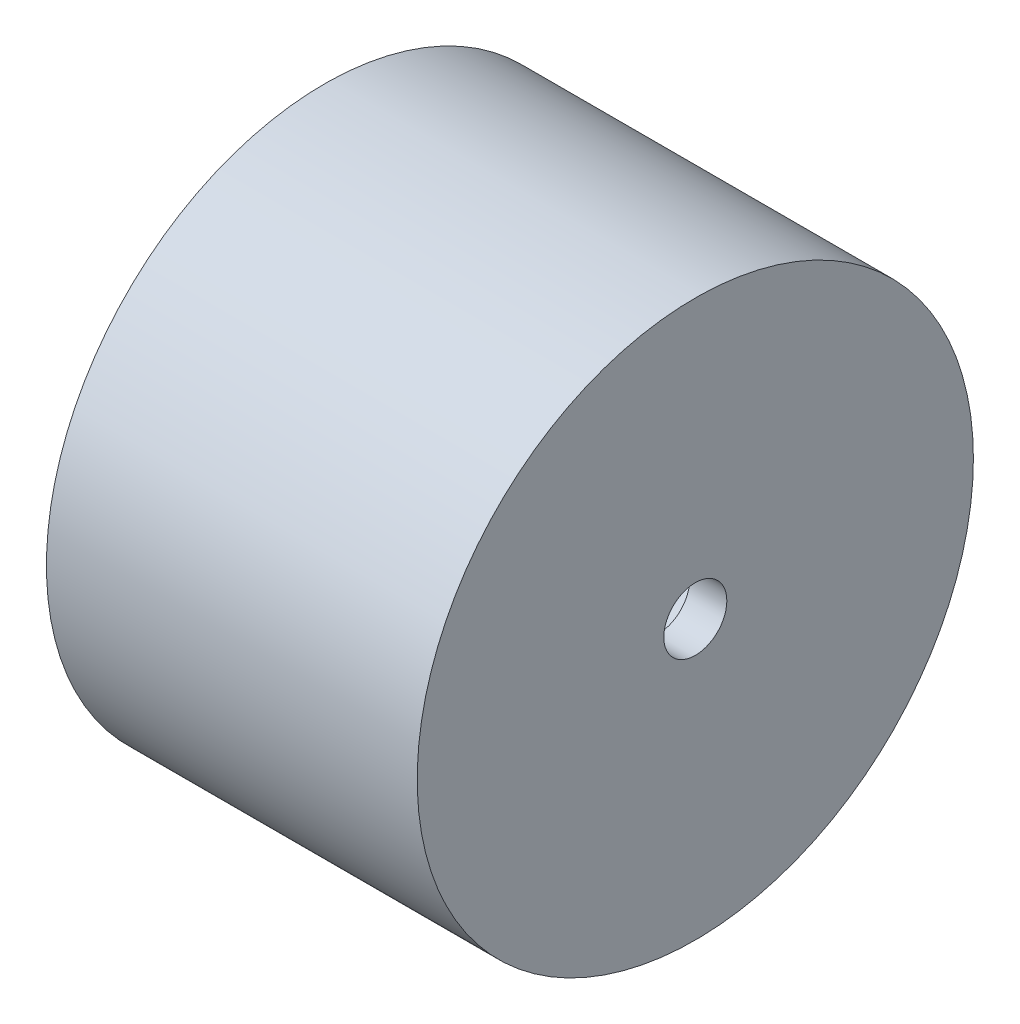
ISO-10303-21;
HEADER;
FILE_DESCRIPTION(('STEP AP214'),'2;1');
FILE_NAME('part.step','',(''),(''),'','','');
FILE_SCHEMA(('AUTOMOTIVE_DESIGN { 1 0 10303 214 1 1 1 1 }'));
ENDSEC;
DATA;
#1=APPLICATION_CONTEXT('core data for automotive mechanical design processes');
#2=APPLICATION_PROTOCOL_DEFINITION('international standard','automotive_design',2000,#1);
#3=PRODUCT_CONTEXT('',#1,'mechanical');
#4=PRODUCT('Part','Part','',(#3));
#5=PRODUCT_RELATED_PRODUCT_CATEGORY('part','',(#4));
#6=PRODUCT_DEFINITION_FORMATION('','',#4);
#7=PRODUCT_DEFINITION_CONTEXT('part definition',#1,'design');
#8=PRODUCT_DEFINITION('design','',#6,#7);
#9=PRODUCT_DEFINITION_SHAPE('','',#8);
#10=(LENGTH_UNIT() NAMED_UNIT(*) SI_UNIT(.MILLI.,.METRE.));
#11=(NAMED_UNIT(*) PLANE_ANGLE_UNIT() SI_UNIT($,.RADIAN.));
#12=(NAMED_UNIT(*) SI_UNIT($,.STERADIAN.) SOLID_ANGLE_UNIT());
#13=UNCERTAINTY_MEASURE_WITH_UNIT(LENGTH_MEASURE(1.E-05),#10,'distance_accuracy_value','');
#14=(GEOMETRIC_REPRESENTATION_CONTEXT(3) GLOBAL_UNCERTAINTY_ASSIGNED_CONTEXT((#13)) GLOBAL_UNIT_ASSIGNED_CONTEXT((#10,
#11,#12)) REPRESENTATION_CONTEXT('',''));
#15=CARTESIAN_POINT('',(0.,0.,0.));
#16=DIRECTION('',(0.,0.,1.));
#17=DIRECTION('',(1.,0.,0.));
#18=AXIS2_PLACEMENT_3D('',#15,#16,#17);
#19=CARTESIAN_POINT('',(20.,0.,0.));
#20=DIRECTION('',(-1.,0.,0.));
#21=DIRECTION('',(0.,0.,1.));
#22=AXIS2_PLACEMENT_3D('',#19,#20,#21);
#23=CYLINDRICAL_SURFACE('',#22,15.);
#24=CARTESIAN_POINT('',(20.,0.,0.));
#25=DIRECTION('',(1.,0.,0.));
#26=DIRECTION('',(0.,0.,-1.));
#27=AXIS2_PLACEMENT_3D('',#24,#25,#26);
#28=CIRCLE('',#27,15.);
#29=CARTESIAN_POINT('',(20.,0.,-15.));
#30=VERTEX_POINT('',#29);
#31=EDGE_CURVE('E10',#30,#30,#28,.T.);
#32=ORIENTED_EDGE('',*,*,#31,.F.);
#33=EDGE_LOOP('',(#32));
#34=FACE_BOUND('',#33,.T.);
#35=CARTESIAN_POINT('',(0.,0.,0.));
#36=DIRECTION('',(1.,0.,0.));
#37=DIRECTION('',(0.,0.,-1.));
#38=AXIS2_PLACEMENT_3D('',#35,#36,#37);
#39=CIRCLE('',#38,15.);
#40=CARTESIAN_POINT('',(0.,0.,-15.));
#41=VERTEX_POINT('',#40);
#42=EDGE_CURVE('E35',#41,#41,#39,.T.);
#43=ORIENTED_EDGE('',*,*,#42,.T.);
#44=EDGE_LOOP('',(#43));
#45=FACE_BOUND('',#44,.T.);
#46=ADVANCED_FACE('F32',(#34,#45),#23,.T.);
#47=CARTESIAN_POINT('',(20.,0.,0.));
#48=DIRECTION('',(1.,0.,0.));
#49=DIRECTION('',(0.,0.,-1.));
#50=AXIS2_PLACEMENT_3D('',#47,#48,#49);
#51=PLANE('',#50);
#52=CARTESIAN_POINT('',(20.,0.,0.));
#53=DIRECTION('',(1.,0.,0.));
#54=DIRECTION('',(0.,0.,-1.));
#55=AXIS2_PLACEMENT_3D('',#52,#53,#54);
#56=CIRCLE('',#55,1.7);
#57=CARTESIAN_POINT('',(20.,0.,-1.7));
#58=VERTEX_POINT('',#57);
#59=EDGE_CURVE('E50',#58,#58,#56,.T.);
#60=ORIENTED_EDGE('',*,*,#59,.F.);
#61=EDGE_LOOP('',(#60));
#62=FACE_BOUND('',#61,.T.);
#63=ORIENTED_EDGE('',*,*,#31,.T.);
#64=EDGE_LOOP('',(#63));
#65=FACE_BOUND('',#64,.T.);
#66=ADVANCED_FACE('F65',(#62,#65),#51,.T.);
#67=CARTESIAN_POINT('',(0.,0.,0.));
#68=DIRECTION('',(1.,0.,0.));
#69=DIRECTION('',(0.,0.,-1.));
#70=AXIS2_PLACEMENT_3D('',#67,#68,#69);
#71=PLANE('',#70);
#72=CARTESIAN_POINT('',(0.,0.,0.));
#73=DIRECTION('',(1.,0.,0.));
#74=DIRECTION('',(0.,0.,-1.));
#75=AXIS2_PLACEMENT_3D('',#72,#73,#74);
#76=CIRCLE('',#75,13.);
#77=CARTESIAN_POINT('',(0.,0.,-13.));
#78=VERTEX_POINT('',#77);
#79=EDGE_CURVE('E44',#78,#78,#76,.T.);
#80=ORIENTED_EDGE('',*,*,#79,.T.);
#81=EDGE_LOOP('',(#80));
#82=FACE_BOUND('',#81,.T.);
#83=ORIENTED_EDGE('',*,*,#42,.F.);
#84=EDGE_LOOP('',(#83));
#85=FACE_BOUND('',#84,.T.);
#86=ADVANCED_FACE('F67',(#82,#85),#71,.F.);
#87=CARTESIAN_POINT('',(20.,0.,0.));
#88=DIRECTION('',(-1.,0.,0.));
#89=DIRECTION('',(0.,0.,1.));
#90=AXIS2_PLACEMENT_3D('',#87,#88,#89);
#91=CYLINDRICAL_SURFACE('',#90,13.);
#92=CARTESIAN_POINT('',(18.,0.,0.));
#93=DIRECTION('',(1.,0.,0.));
#94=DIRECTION('',(0.,0.,-1.));
#95=AXIS2_PLACEMENT_3D('',#92,#93,#94);
#96=CIRCLE('',#95,13.);
#97=CARTESIAN_POINT('',(18.,0.,-13.));
#98=VERTEX_POINT('',#97);
#99=EDGE_CURVE('E42',#98,#98,#96,.T.);
#100=ORIENTED_EDGE('',*,*,#99,.T.);
#101=EDGE_LOOP('',(#100));
#102=FACE_BOUND('',#101,.T.);
#103=ORIENTED_EDGE('',*,*,#79,.F.);
#104=EDGE_LOOP('',(#103));
#105=FACE_BOUND('',#104,.T.);
#106=ADVANCED_FACE('F73',(#102,#105),#91,.F.);
#107=CARTESIAN_POINT('',(18.,0.,0.));
#108=DIRECTION('',(1.,0.,0.));
#109=DIRECTION('',(0.,0.,-1.));
#110=AXIS2_PLACEMENT_3D('',#107,#108,#109);
#111=PLANE('',#110);
#112=CARTESIAN_POINT('',(18.,0.,0.));
#113=DIRECTION('',(1.,0.,0.));
#114=DIRECTION('',(0.,0.,-1.));
#115=AXIS2_PLACEMENT_3D('',#112,#113,#114);
#116=CIRCLE('',#115,1.7);
#117=CARTESIAN_POINT('',(18.,0.,-1.7));
#118=VERTEX_POINT('',#117);
#119=EDGE_CURVE('E47',#118,#118,#116,.T.);
#120=ORIENTED_EDGE('',*,*,#119,.T.);
#121=EDGE_LOOP('',(#120));
#122=FACE_BOUND('',#121,.T.);
#123=ORIENTED_EDGE('',*,*,#99,.F.);
#124=EDGE_LOOP('',(#123));
#125=FACE_BOUND('',#124,.T.);
#126=ADVANCED_FACE('F56',(#122,#125),#111,.F.);
#127=CARTESIAN_POINT('',(18.,0.,0.));
#128=DIRECTION('',(1.,0.,0.));
#129=DIRECTION('',(0.,0.,-1.));
#130=AXIS2_PLACEMENT_3D('',#127,#128,#129);
#131=CYLINDRICAL_SURFACE('',#130,1.7);
#132=ORIENTED_EDGE('',*,*,#119,.F.);
#133=EDGE_LOOP('',(#132));
#134=FACE_BOUND('',#133,.T.);
#135=ORIENTED_EDGE('',*,*,#59,.T.);
#136=EDGE_LOOP('',(#135));
#137=FACE_BOUND('',#136,.T.);
#138=ADVANCED_FACE('F59',(#134,#137),#131,.F.);
#139=CLOSED_SHELL('',(#46,#66,#86,#106,#126,#138));
#140=MANIFOLD_SOLID_BREP('B2',#139);
#141=ADVANCED_BREP_SHAPE_REPRESENTATION('',(#18,#140),#14);
#142=SHAPE_DEFINITION_REPRESENTATION(#9,#141);
ENDSEC;
END-ISO-10303-21;
